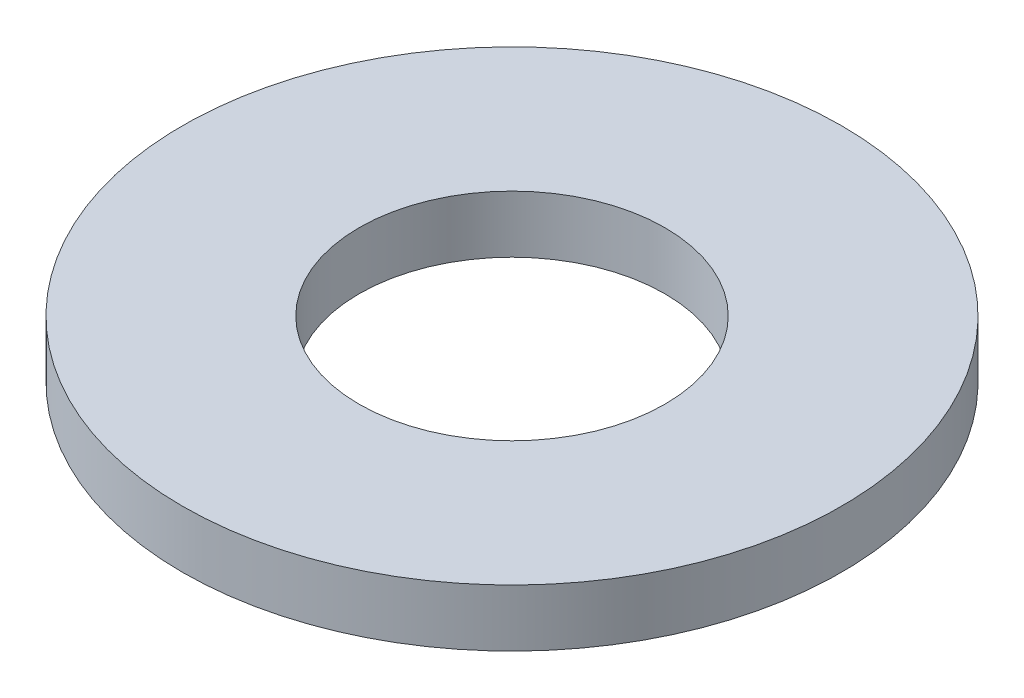
ISO-10303-21;
HEADER;
FILE_DESCRIPTION(('STEP AP214'),'2;1');
FILE_NAME('part.step','',(''),(''),'','','');
FILE_SCHEMA(('AUTOMOTIVE_DESIGN { 1 0 10303 214 1 1 1 1 }'));
ENDSEC;
DATA;
#1=APPLICATION_CONTEXT('core data for automotive mechanical design processes');
#2=APPLICATION_PROTOCOL_DEFINITION('international standard','automotive_design',2000,#1);
#3=PRODUCT_CONTEXT('',#1,'mechanical');
#4=PRODUCT('Part','Part','',(#3));
#5=PRODUCT_RELATED_PRODUCT_CATEGORY('part','',(#4));
#6=PRODUCT_DEFINITION_FORMATION('','',#4);
#7=PRODUCT_DEFINITION_CONTEXT('part definition',#1,'design');
#8=PRODUCT_DEFINITION('design','',#6,#7);
#9=PRODUCT_DEFINITION_SHAPE('','',#8);
#10=(LENGTH_UNIT() NAMED_UNIT(*) SI_UNIT(.MILLI.,.METRE.));
#11=(NAMED_UNIT(*) PLANE_ANGLE_UNIT() SI_UNIT($,.RADIAN.));
#12=(NAMED_UNIT(*) SI_UNIT($,.STERADIAN.) SOLID_ANGLE_UNIT());
#13=UNCERTAINTY_MEASURE_WITH_UNIT(LENGTH_MEASURE(1.E-05),#10,'distance_accuracy_value','');
#14=(GEOMETRIC_REPRESENTATION_CONTEXT(3) GLOBAL_UNCERTAINTY_ASSIGNED_CONTEXT((#13)) GLOBAL_UNIT_ASSIGNED_CONTEXT((#10,
#11,#12)) REPRESENTATION_CONTEXT('',''));
#15=CARTESIAN_POINT('',(0.,0.,0.));
#16=DIRECTION('',(0.,0.,1.));
#17=DIRECTION('',(1.,0.,0.));
#18=AXIS2_PLACEMENT_3D('',#15,#16,#17);
#19=CARTESIAN_POINT('',(0.,0.9652,0.));
#20=DIRECTION('',(0.,-1.,0.));
#21=DIRECTION('',(0.,0.,-1.));
#22=AXIS2_PLACEMENT_3D('',#19,#20,#21);
#23=CYLINDRICAL_SURFACE('',#22,5.55625);
#24=CARTESIAN_POINT('',(0.,0.9652,0.));
#25=DIRECTION('',(0.,1.,0.));
#26=DIRECTION('',(0.,0.,1.));
#27=AXIS2_PLACEMENT_3D('',#24,#25,#26);
#28=CIRCLE('',#27,5.55625);
#29=CARTESIAN_POINT('',(0.,0.9652,5.55625));
#30=VERTEX_POINT('',#29);
#31=EDGE_CURVE('E10',#30,#30,#28,.T.);
#32=ORIENTED_EDGE('',*,*,#31,.F.);
#33=EDGE_LOOP('',(#32));
#34=FACE_BOUND('',#33,.T.);
#35=CARTESIAN_POINT('',(0.,0.,0.));
#36=DIRECTION('',(0.,1.,0.));
#37=DIRECTION('',(0.,0.,1.));
#38=AXIS2_PLACEMENT_3D('',#35,#36,#37);
#39=CIRCLE('',#38,5.55625);
#40=CARTESIAN_POINT('',(0.,0.,5.55625));
#41=VERTEX_POINT('',#40);
#42=EDGE_CURVE('E33',#41,#41,#39,.T.);
#43=ORIENTED_EDGE('',*,*,#42,.T.);
#44=EDGE_LOOP('',(#43));
#45=FACE_BOUND('',#44,.T.);
#46=ADVANCED_FACE('F30',(#34,#45),#23,.T.);
#47=CARTESIAN_POINT('',(0.,0.9652,0.));
#48=DIRECTION('',(0.,1.,0.));
#49=DIRECTION('',(0.,0.,1.));
#50=AXIS2_PLACEMENT_3D('',#47,#48,#49);
#51=PLANE('',#50);
#52=CARTESIAN_POINT('',(0.,0.9652,0.));
#53=DIRECTION('',(0.,1.,0.));
#54=DIRECTION('',(0.,0.,1.));
#55=AXIS2_PLACEMENT_3D('',#52,#53,#54);
#56=CIRCLE('',#55,2.5781);
#57=CARTESIAN_POINT('',(0.,0.9652,2.5781));
#58=VERTEX_POINT('',#57);
#59=EDGE_CURVE('E42',#58,#58,#56,.T.);
#60=ORIENTED_EDGE('',*,*,#59,.F.);
#61=EDGE_LOOP('',(#60));
#62=FACE_BOUND('',#61,.T.);
#63=ORIENTED_EDGE('',*,*,#31,.T.);
#64=EDGE_LOOP('',(#63));
#65=FACE_BOUND('',#64,.T.);
#66=ADVANCED_FACE('F57',(#62,#65),#51,.T.);
#67=CARTESIAN_POINT('',(0.,0.,0.));
#68=DIRECTION('',(0.,1.,0.));
#69=DIRECTION('',(0.,0.,1.));
#70=AXIS2_PLACEMENT_3D('',#67,#68,#69);
#71=PLANE('',#70);
#72=CARTESIAN_POINT('',(0.,0.,0.));
#73=DIRECTION('',(0.,1.,0.));
#74=DIRECTION('',(0.,0.,1.));
#75=AXIS2_PLACEMENT_3D('',#72,#73,#74);
#76=CIRCLE('',#75,2.5781);
#77=CARTESIAN_POINT('',(0.,0.,2.5781));
#78=VERTEX_POINT('',#77);
#79=EDGE_CURVE('E40',#78,#78,#76,.T.);
#80=ORIENTED_EDGE('',*,*,#79,.T.);
#81=EDGE_LOOP('',(#80));
#82=FACE_BOUND('',#81,.T.);
#83=ORIENTED_EDGE('',*,*,#42,.F.);
#84=EDGE_LOOP('',(#83));
#85=FACE_BOUND('',#84,.T.);
#86=ADVANCED_FACE('F48',(#82,#85),#71,.F.);
#87=CARTESIAN_POINT('',(0.,0.,0.));
#88=DIRECTION('',(0.,1.,0.));
#89=DIRECTION('',(0.,0.,1.));
#90=AXIS2_PLACEMENT_3D('',#87,#88,#89);
#91=CYLINDRICAL_SURFACE('',#90,2.5781);
#92=ORIENTED_EDGE('',*,*,#79,.F.);
#93=EDGE_LOOP('',(#92));
#94=FACE_BOUND('',#93,.T.);
#95=ORIENTED_EDGE('',*,*,#59,.T.);
#96=EDGE_LOOP('',(#95));
#97=FACE_BOUND('',#96,.T.);
#98=ADVANCED_FACE('F51',(#94,#97),#91,.F.);
#99=CLOSED_SHELL('',(#46,#66,#86,#98));
#100=MANIFOLD_SOLID_BREP('B2',#99);
#101=ADVANCED_BREP_SHAPE_REPRESENTATION('',(#18,#100),#14);
#102=SHAPE_DEFINITION_REPRESENTATION(#9,#101);
ENDSEC;
END-ISO-10303-21;
